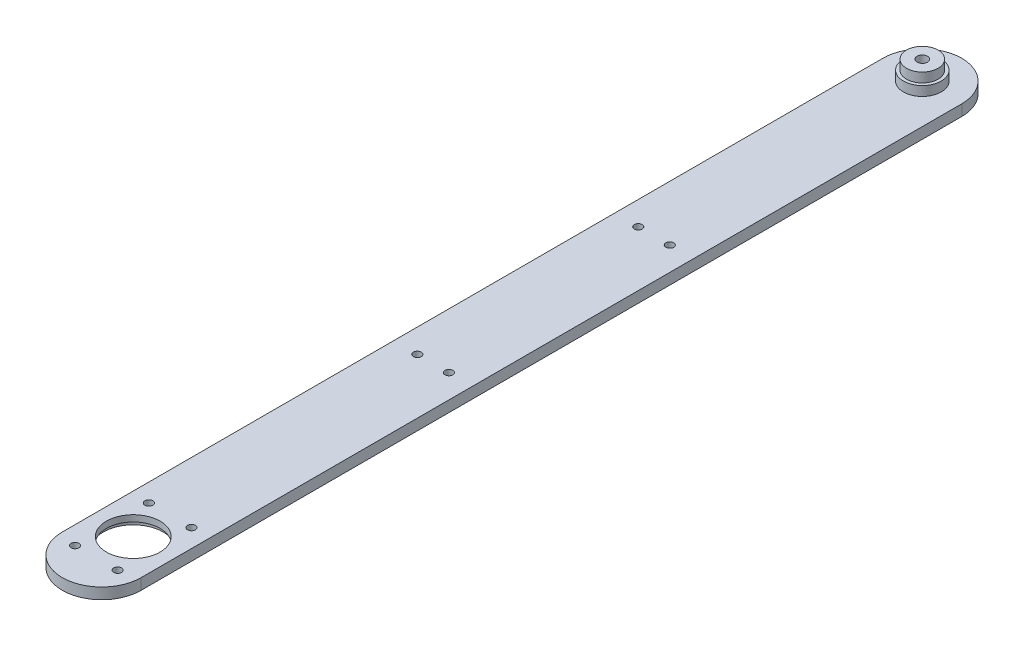
ISO-10303-21;
HEADER;
FILE_DESCRIPTION(('STEP AP214'),'2;1');
FILE_NAME('part.step','',(''),(''),'','','');
FILE_SCHEMA(('AUTOMOTIVE_DESIGN { 1 0 10303 214 1 1 1 1 }'));
ENDSEC;
DATA;
#1=APPLICATION_CONTEXT('core data for automotive mechanical design processes');
#2=APPLICATION_PROTOCOL_DEFINITION('international standard','automotive_design',2000,#1);
#3=PRODUCT_CONTEXT('',#1,'mechanical');
#4=PRODUCT('Part','Part','',(#3));
#5=PRODUCT_RELATED_PRODUCT_CATEGORY('part','',(#4));
#6=PRODUCT_DEFINITION_FORMATION('','',#4);
#7=PRODUCT_DEFINITION_CONTEXT('part definition',#1,'design');
#8=PRODUCT_DEFINITION('design','',#6,#7);
#9=PRODUCT_DEFINITION_SHAPE('','',#8);
#10=(LENGTH_UNIT() NAMED_UNIT(*) SI_UNIT(.MILLI.,.METRE.));
#11=(NAMED_UNIT(*) PLANE_ANGLE_UNIT() SI_UNIT($,.RADIAN.));
#12=(NAMED_UNIT(*) SI_UNIT($,.STERADIAN.) SOLID_ANGLE_UNIT());
#13=UNCERTAINTY_MEASURE_WITH_UNIT(LENGTH_MEASURE(1.E-05),#10,'distance_accuracy_value','');
#14=(GEOMETRIC_REPRESENTATION_CONTEXT(3) GLOBAL_UNCERTAINTY_ASSIGNED_CONTEXT((#13)) GLOBAL_UNIT_ASSIGNED_CONTEXT((#10,
#11,#12)) REPRESENTATION_CONTEXT('',''));
#15=CARTESIAN_POINT('',(0.,0.,0.));
#16=DIRECTION('',(0.,0.,1.));
#17=DIRECTION('',(1.,0.,0.));
#18=AXIS2_PLACEMENT_3D('',#15,#16,#17);
#19=CARTESIAN_POINT('',(-23.3733322792316,1.,-1111.));
#20=DIRECTION('',(0.,1.,0.));
#21=DIRECTION('',(0.,0.,1.));
#22=AXIS2_PLACEMENT_3D('',#19,#20,#21);
#23=PLANE('',#22);
#24=CARTESIAN_POINT('',(6.75000000000007,1.,238.30865704891));
#25=DIRECTION('',(0.,-1.,0.));
#26=DIRECTION('',(0.,0.,-1.));
#27=AXIS2_PLACEMENT_3D('',#24,#25,#26);
#28=CIRCLE('',#27,1.25);
#29=CARTESIAN_POINT('',(6.75000000000007,1.,237.05865704891));
#30=VERTEX_POINT('',#29);
#31=EDGE_CURVE('E278',#30,#30,#28,.T.);
#32=ORIENTED_EDGE('',*,*,#31,.F.);
#33=EDGE_LOOP('',(#32));
#34=FACE_BOUND('',#33,.T.);
#35=CARTESIAN_POINT('',(-6.74999999999987,1.,238.30865704891));
#36=DIRECTION('',(0.,-1.,0.));
#37=DIRECTION('',(0.,0.,-1.));
#38=AXIS2_PLACEMENT_3D('',#35,#36,#37);
#39=CIRCLE('',#38,1.25);
#40=CARTESIAN_POINT('',(-6.74999999999987,1.,237.05865704891));
#41=VERTEX_POINT('',#40);
#42=EDGE_CURVE('E284',#41,#41,#39,.T.);
#43=ORIENTED_EDGE('',*,*,#42,.F.);
#44=EDGE_LOOP('',(#43));
#45=FACE_BOUND('',#44,.T.);
#46=CARTESIAN_POINT('',(-6.75000000000001,1.,261.69134295109));
#47=DIRECTION('',(0.,-1.,0.));
#48=DIRECTION('',(0.,0.,-1.));
#49=AXIS2_PLACEMENT_3D('',#46,#47,#48);
#50=CIRCLE('',#49,1.25);
#51=CARTESIAN_POINT('',(-6.75000000000001,1.,260.44134295109));
#52=VERTEX_POINT('',#51);
#53=EDGE_CURVE('E292',#52,#52,#50,.T.);
#54=ORIENTED_EDGE('',*,*,#53,.F.);
#55=EDGE_LOOP('',(#54));
#56=FACE_BOUND('',#55,.T.);
#57=CARTESIAN_POINT('',(-4.99999999999999,1.,85.));
#58=DIRECTION('',(0.,-1.,0.));
#59=DIRECTION('',(0.,0.,-1.));
#60=AXIS2_PLACEMENT_3D('',#57,#58,#59);
#61=CIRCLE('',#60,1.25);
#62=CARTESIAN_POINT('',(-4.99999999999999,1.,83.75));
#63=VERTEX_POINT('',#62);
#64=EDGE_CURVE('E137',#63,#63,#61,.T.);
#65=ORIENTED_EDGE('',*,*,#64,.F.);
#66=EDGE_LOOP('',(#65));
#67=FACE_BOUND('',#66,.T.);
#68=CARTESIAN_POINT('',(0.,1.,0.));
#69=DIRECTION('',(0.,1.,0.));
#70=DIRECTION('',(0.,0.,1.));
#71=AXIS2_PLACEMENT_3D('',#68,#69,#70);
#72=CIRCLE('',#71,12.5);
#73=CARTESIAN_POINT('',(-12.5,1.,0.));
#74=VERTEX_POINT('',#73);
#75=CARTESIAN_POINT('',(12.5,1.,0.));
#76=VERTEX_POINT('',#75);
#77=EDGE_CURVE('E86',#74,#76,#72,.F.);
#78=ORIENTED_EDGE('',*,*,#77,.T.);
#79=DIRECTION('',(0.,0.,1.));
#80=VECTOR('',#79,1.);
#81=CARTESIAN_POINT('',(12.5,1.,0.));
#82=LINE('',#81,#80);
#83=CARTESIAN_POINT('',(12.5,1.,260.));
#84=VERTEX_POINT('',#83);
#85=EDGE_CURVE('E100',#76,#84,#82,.T.);
#86=ORIENTED_EDGE('',*,*,#85,.T.);
#87=CARTESIAN_POINT('',(0.,1.,260.));
#88=DIRECTION('',(0.,1.,0.));
#89=DIRECTION('',(0.,0.,1.));
#90=AXIS2_PLACEMENT_3D('',#87,#88,#89);
#91=CIRCLE('',#90,12.5);
#92=CARTESIAN_POINT('',(-12.4999999999999,1.,260.));
#93=VERTEX_POINT('',#92);
#94=EDGE_CURVE('E58',#84,#93,#91,.F.);
#95=ORIENTED_EDGE('',*,*,#94,.T.);
#96=DIRECTION('',(0.,0.,-1.));
#97=VECTOR('',#96,1.);
#98=CARTESIAN_POINT('',(-12.5,1.,0.));
#99=LINE('',#98,#97);
#100=EDGE_CURVE('E83',#93,#74,#99,.T.);
#101=ORIENTED_EDGE('',*,*,#100,.T.);
#102=EDGE_LOOP('',(#78,#86,#95,#101));
#103=FACE_BOUND('',#102,.T.);
#104=CARTESIAN_POINT('',(0.,0.999999999999999,0.));
#105=DIRECTION('',(0.,1.,0.));
#106=DIRECTION('',(0.,0.,1.));
#107=AXIS2_PLACEMENT_3D('',#104,#105,#106);
#108=CIRCLE('',#107,1.65);
#109=CARTESIAN_POINT('',(0.,0.999999999999999,1.65));
#110=VERTEX_POINT('',#109);
#111=EDGE_CURVE('E133',#110,#110,#108,.F.);
#112=ORIENTED_EDGE('',*,*,#111,.F.);
#113=EDGE_LOOP('',(#112));
#114=FACE_BOUND('',#113,.T.);
#115=CARTESIAN_POINT('',(0.,1.,250.));
#116=DIRECTION('',(0.,1.,0.));
#117=DIRECTION('',(0.,0.,1.));
#118=AXIS2_PLACEMENT_3D('',#115,#116,#117);
#119=CIRCLE('',#118,9.50000000000001);
#120=CARTESIAN_POINT('',(0.,1.,259.5));
#121=VERTEX_POINT('',#120);
#122=EDGE_CURVE('E91',#121,#121,#119,.F.);
#123=ORIENTED_EDGE('',*,*,#122,.F.);
#124=EDGE_LOOP('',(#123));
#125=FACE_BOUND('',#124,.T.);
#126=CARTESIAN_POINT('',(-4.99999999999997,1.,155.));
#127=DIRECTION('',(0.,-1.,0.));
#128=DIRECTION('',(0.,0.,-1.));
#129=AXIS2_PLACEMENT_3D('',#126,#127,#128);
#130=CIRCLE('',#129,1.25);
#131=CARTESIAN_POINT('',(-4.99999999999997,1.,153.75));
#132=VERTEX_POINT('',#131);
#133=EDGE_CURVE('E141',#132,#132,#130,.T.);
#134=ORIENTED_EDGE('',*,*,#133,.F.);
#135=EDGE_LOOP('',(#134));
#136=FACE_BOUND('',#135,.T.);
#137=CARTESIAN_POINT('',(5.00000000000001,1.,85.));
#138=DIRECTION('',(0.,-1.,0.));
#139=DIRECTION('',(0.,0.,-1.));
#140=AXIS2_PLACEMENT_3D('',#137,#138,#139);
#141=CIRCLE('',#140,1.25);
#142=CARTESIAN_POINT('',(5.00000000000001,1.,83.75));
#143=VERTEX_POINT('',#142);
#144=EDGE_CURVE('E149',#143,#143,#141,.T.);
#145=ORIENTED_EDGE('',*,*,#144,.F.);
#146=EDGE_LOOP('',(#145));
#147=FACE_BOUND('',#146,.T.);
#148=CARTESIAN_POINT('',(5.00000000000003,1.,155.));
#149=DIRECTION('',(0.,-1.,0.));
#150=DIRECTION('',(0.,0.,-1.));
#151=AXIS2_PLACEMENT_3D('',#148,#149,#150);
#152=CIRCLE('',#151,1.25);
#153=CARTESIAN_POINT('',(5.00000000000003,1.,153.75));
#154=VERTEX_POINT('',#153);
#155=EDGE_CURVE('E11',#154,#154,#152,.T.);
#156=ORIENTED_EDGE('',*,*,#155,.F.);
#157=EDGE_LOOP('',(#156));
#158=FACE_BOUND('',#157,.T.);
#159=CARTESIAN_POINT('',(6.74999999999987,1.,261.69134295109));
#160=DIRECTION('',(0.,-1.,0.));
#161=DIRECTION('',(0.,0.,-1.));
#162=AXIS2_PLACEMENT_3D('',#159,#160,#161);
#163=CIRCLE('',#162,1.25);
#164=CARTESIAN_POINT('',(6.74999999999987,1.,260.44134295109));
#165=VERTEX_POINT('',#164);
#166=EDGE_CURVE('E271',#165,#165,#163,.T.);
#167=ORIENTED_EDGE('',*,*,#166,.F.);
#168=EDGE_LOOP('',(#167));
#169=FACE_BOUND('',#168,.T.);
#170=ADVANCED_FACE('F41',(#34,#45,#56,#67,#103,#114,#125,#136,#147,#158,#169),#23,.F.);
#171=CARTESIAN_POINT('',(5.00000000000003,1.,155.));
#172=DIRECTION('',(0.,-1.,0.));
#173=DIRECTION('',(0.,0.,-1.));
#174=AXIS2_PLACEMENT_3D('',#171,#172,#173);
#175=CYLINDRICAL_SURFACE('',#174,1.25);
#176=CARTESIAN_POINT('',(5.00000000000003,4.5,155.));
#177=DIRECTION('',(0.,1.,0.));
#178=DIRECTION('',(0.,0.,1.));
#179=AXIS2_PLACEMENT_3D('',#176,#177,#178);
#180=CIRCLE('',#179,1.25);
#181=CARTESIAN_POINT('',(5.00000000000003,4.5,156.25));
#182=VERTEX_POINT('',#181);
#183=EDGE_CURVE('E51',#182,#182,#180,.T.);
#184=ORIENTED_EDGE('',*,*,#183,.T.);
#185=EDGE_LOOP('',(#184));
#186=FACE_BOUND('',#185,.T.);
#187=ORIENTED_EDGE('',*,*,#155,.T.);
#188=EDGE_LOOP('',(#187));
#189=FACE_BOUND('',#188,.T.);
#190=ADVANCED_FACE('F43',(#186,#189),#175,.F.);
#191=CARTESIAN_POINT('',(5.00000000000001,1.,85.));
#192=DIRECTION('',(0.,-1.,0.));
#193=DIRECTION('',(0.,0.,-1.));
#194=AXIS2_PLACEMENT_3D('',#191,#192,#193);
#195=CYLINDRICAL_SURFACE('',#194,1.25);
#196=CARTESIAN_POINT('',(5.00000000000001,4.5,85.));
#197=DIRECTION('',(0.,1.,0.));
#198=DIRECTION('',(0.,0.,1.));
#199=AXIS2_PLACEMENT_3D('',#196,#197,#198);
#200=CIRCLE('',#199,1.25);
#201=CARTESIAN_POINT('',(5.00000000000001,4.5,86.25));
#202=VERTEX_POINT('',#201);
#203=EDGE_CURVE('E145',#202,#202,#200,.T.);
#204=ORIENTED_EDGE('',*,*,#203,.T.);
#205=EDGE_LOOP('',(#204));
#206=FACE_BOUND('',#205,.T.);
#207=ORIENTED_EDGE('',*,*,#144,.T.);
#208=EDGE_LOOP('',(#207));
#209=FACE_BOUND('',#208,.T.);
#210=ADVANCED_FACE('F182',(#206,#209),#195,.F.);
#211=CARTESIAN_POINT('',(-4.99999999999997,1.,155.));
#212=DIRECTION('',(0.,-1.,0.));
#213=DIRECTION('',(0.,0.,-1.));
#214=AXIS2_PLACEMENT_3D('',#211,#212,#213);
#215=CYLINDRICAL_SURFACE('',#214,1.25);
#216=CARTESIAN_POINT('',(-4.99999999999997,4.5,155.));
#217=DIRECTION('',(0.,1.,0.));
#218=DIRECTION('',(0.,0.,1.));
#219=AXIS2_PLACEMENT_3D('',#216,#217,#218);
#220=CIRCLE('',#219,1.25);
#221=CARTESIAN_POINT('',(-4.99999999999997,4.5,156.25));
#222=VERTEX_POINT('',#221);
#223=EDGE_CURVE('E126',#222,#222,#220,.T.);
#224=ORIENTED_EDGE('',*,*,#223,.T.);
#225=EDGE_LOOP('',(#224));
#226=FACE_BOUND('',#225,.T.);
#227=ORIENTED_EDGE('',*,*,#133,.T.);
#228=EDGE_LOOP('',(#227));
#229=FACE_BOUND('',#228,.T.);
#230=ADVANCED_FACE('F250',(#226,#229),#215,.F.);
#231=CARTESIAN_POINT('',(0.,-4.5,0.));
#232=DIRECTION('',(0.,1.,0.));
#233=DIRECTION('',(0.,0.,1.));
#234=AXIS2_PLACEMENT_3D('',#231,#232,#233);
#235=CYLINDRICAL_SURFACE('',#234,12.5);
#236=ORIENTED_EDGE('',*,*,#77,.F.);
#237=DIRECTION('',(0.,1.,0.));
#238=VECTOR('',#237,1.);
#239=CARTESIAN_POINT('',(-12.5,-4.5,0.));
#240=LINE('',#239,#238);
#241=CARTESIAN_POINT('',(-12.5,4.5,0.));
#242=VERTEX_POINT('',#241);
#243=EDGE_CURVE('E96',#74,#242,#240,.T.);
#244=ORIENTED_EDGE('',*,*,#243,.T.);
#245=CARTESIAN_POINT('',(0.,4.5,0.));
#246=DIRECTION('',(0.,1.,0.));
#247=DIRECTION('',(0.,0.,1.));
#248=AXIS2_PLACEMENT_3D('',#245,#246,#247);
#249=CIRCLE('',#248,12.5);
#250=CARTESIAN_POINT('',(12.5,4.5,0.));
#251=VERTEX_POINT('',#250);
#252=EDGE_CURVE('E220',#251,#242,#249,.T.);
#253=ORIENTED_EDGE('',*,*,#252,.F.);
#254=DIRECTION('',(0.,1.,0.));
#255=VECTOR('',#254,1.);
#256=CARTESIAN_POINT('',(12.5,-4.5,0.));
#257=LINE('',#256,#255);
#258=EDGE_CURVE('E66',#76,#251,#257,.T.);
#259=ORIENTED_EDGE('',*,*,#258,.F.);
#260=EDGE_LOOP('',(#236,#244,#253,#259));
#261=FACE_BOUND('',#260,.T.);
#262=ADVANCED_FACE('F94',(#261),#235,.T.);
#263=CARTESIAN_POINT('',(12.5,-4.5,0.));
#264=DIRECTION('',(1.,0.,0.));
#265=DIRECTION('',(0.,0.,-1.));
#266=AXIS2_PLACEMENT_3D('',#263,#264,#265);
#267=PLANE('',#266);
#268=ORIENTED_EDGE('',*,*,#85,.F.);
#269=ORIENTED_EDGE('',*,*,#258,.T.);
#270=DIRECTION('',(0.,0.,-1.));
#271=VECTOR('',#270,1.);
#272=CARTESIAN_POINT('',(12.5,4.5,0.));
#273=LINE('',#272,#271);
#274=CARTESIAN_POINT('',(12.5,4.5,260.));
#275=VERTEX_POINT('',#274);
#276=EDGE_CURVE('E108',#275,#251,#273,.T.);
#277=ORIENTED_EDGE('',*,*,#276,.F.);
#278=DIRECTION('',(0.,1.,0.));
#279=VECTOR('',#278,1.);
#280=CARTESIAN_POINT('',(12.5,-4.5,260.));
#281=LINE('',#280,#279);
#282=EDGE_CURVE('E112',#84,#275,#281,.T.);
#283=ORIENTED_EDGE('',*,*,#282,.F.);
#284=EDGE_LOOP('',(#268,#269,#277,#283));
#285=FACE_BOUND('',#284,.T.);
#286=ADVANCED_FACE('F243',(#285),#267,.T.);
#287=CARTESIAN_POINT('',(0.,-4.5,260.));
#288=DIRECTION('',(0.,1.,0.));
#289=DIRECTION('',(0.,0.,1.));
#290=AXIS2_PLACEMENT_3D('',#287,#288,#289);
#291=CYLINDRICAL_SURFACE('',#290,12.5);
#292=ORIENTED_EDGE('',*,*,#94,.F.);
#293=ORIENTED_EDGE('',*,*,#282,.T.);
#294=CARTESIAN_POINT('',(0.,4.5,260.));
#295=DIRECTION('',(0.,1.,0.));
#296=DIRECTION('',(0.,0.,1.));
#297=AXIS2_PLACEMENT_3D('',#294,#295,#296);
#298=CIRCLE('',#297,12.5);
#299=CARTESIAN_POINT('',(-12.4999999999999,4.5,260.));
#300=VERTEX_POINT('',#299);
#301=EDGE_CURVE('E114',#300,#275,#298,.T.);
#302=ORIENTED_EDGE('',*,*,#301,.F.);
#303=DIRECTION('',(0.,1.,0.));
#304=VECTOR('',#303,1.);
#305=CARTESIAN_POINT('',(-12.4999999999999,-4.5,260.));
#306=LINE('',#305,#304);
#307=EDGE_CURVE('E107',#93,#300,#306,.T.);
#308=ORIENTED_EDGE('',*,*,#307,.F.);
#309=EDGE_LOOP('',(#292,#293,#302,#308));
#310=FACE_BOUND('',#309,.T.);
#311=ADVANCED_FACE('F171',(#310),#291,.T.);
#312=CARTESIAN_POINT('',(-12.5,-4.5,0.));
#313=DIRECTION('',(-1.,0.,0.));
#314=DIRECTION('',(0.,0.,1.));
#315=AXIS2_PLACEMENT_3D('',#312,#313,#314);
#316=PLANE('',#315);
#317=ORIENTED_EDGE('',*,*,#100,.F.);
#318=ORIENTED_EDGE('',*,*,#307,.T.);
#319=DIRECTION('',(0.,0.,1.));
#320=VECTOR('',#319,1.);
#321=CARTESIAN_POINT('',(-12.5,4.5,0.));
#322=LINE('',#321,#320);
#323=EDGE_CURVE('E104',#242,#300,#322,.T.);
#324=ORIENTED_EDGE('',*,*,#323,.F.);
#325=ORIENTED_EDGE('',*,*,#243,.F.);
#326=EDGE_LOOP('',(#317,#318,#324,#325));
#327=FACE_BOUND('',#326,.T.);
#328=ADVANCED_FACE('F102',(#327),#316,.T.);
#329=CARTESIAN_POINT('',(0.,4.5,0.));
#330=DIRECTION('',(0.,1.,0.));
#331=DIRECTION('',(0.,0.,1.));
#332=AXIS2_PLACEMENT_3D('',#329,#330,#331);
#333=PLANE('',#332);
#334=CARTESIAN_POINT('',(6.74999999999987,4.5,261.69134295109));
#335=DIRECTION('',(0.,1.,0.));
#336=DIRECTION('',(0.,0.,1.));
#337=AXIS2_PLACEMENT_3D('',#334,#335,#336);
#338=CIRCLE('',#337,1.25);
#339=CARTESIAN_POINT('',(6.74999999999987,4.5,262.94134295109));
#340=VERTEX_POINT('',#339);
#341=EDGE_CURVE('E274',#340,#340,#338,.T.);
#342=ORIENTED_EDGE('',*,*,#341,.F.);
#343=EDGE_LOOP('',(#342));
#344=FACE_BOUND('',#343,.T.);
#345=CARTESIAN_POINT('',(6.75000000000007,4.5,238.30865704891));
#346=DIRECTION('',(0.,1.,0.));
#347=DIRECTION('',(0.,0.,1.));
#348=AXIS2_PLACEMENT_3D('',#345,#346,#347);
#349=CIRCLE('',#348,1.25);
#350=CARTESIAN_POINT('',(6.75000000000007,4.5,239.55865704891));
#351=VERTEX_POINT('',#350);
#352=EDGE_CURVE('E45',#351,#351,#349,.T.);
#353=ORIENTED_EDGE('',*,*,#352,.F.);
#354=EDGE_LOOP('',(#353));
#355=FACE_BOUND('',#354,.T.);
#356=CARTESIAN_POINT('',(-6.74999999999987,4.5,238.30865704891));
#357=DIRECTION('',(0.,1.,0.));
#358=DIRECTION('',(0.,0.,1.));
#359=AXIS2_PLACEMENT_3D('',#356,#357,#358);
#360=CIRCLE('',#359,1.25);
#361=CARTESIAN_POINT('',(-6.74999999999987,4.5,239.55865704891));
#362=VERTEX_POINT('',#361);
#363=EDGE_CURVE('E288',#362,#362,#360,.T.);
#364=ORIENTED_EDGE('',*,*,#363,.F.);
#365=EDGE_LOOP('',(#364));
#366=FACE_BOUND('',#365,.T.);
#367=CARTESIAN_POINT('',(-6.75000000000001,4.5,261.69134295109));
#368=DIRECTION('',(0.,1.,0.));
#369=DIRECTION('',(0.,0.,1.));
#370=AXIS2_PLACEMENT_3D('',#367,#368,#369);
#371=CIRCLE('',#370,1.25);
#372=CARTESIAN_POINT('',(-6.75000000000001,4.5,262.94134295109));
#373=VERTEX_POINT('',#372);
#374=EDGE_CURVE('E296',#373,#373,#371,.T.);
#375=ORIENTED_EDGE('',*,*,#374,.F.);
#376=EDGE_LOOP('',(#375));
#377=FACE_BOUND('',#376,.T.);
#378=CARTESIAN_POINT('',(-4.99999999999999,4.5,85.));
#379=DIRECTION('',(0.,1.,0.));
#380=DIRECTION('',(0.,0.,1.));
#381=AXIS2_PLACEMENT_3D('',#378,#379,#380);
#382=CIRCLE('',#381,1.25);
#383=CARTESIAN_POINT('',(-4.99999999999999,4.5,86.25));
#384=VERTEX_POINT('',#383);
#385=EDGE_CURVE('E300',#384,#384,#382,.T.);
#386=ORIENTED_EDGE('',*,*,#385,.F.);
#387=EDGE_LOOP('',(#386));
#388=FACE_BOUND('',#387,.T.);
#389=CARTESIAN_POINT('',(0.,4.5,250.));
#390=DIRECTION('',(0.,1.,0.));
#391=DIRECTION('',(0.,0.,1.));
#392=AXIS2_PLACEMENT_3D('',#389,#390,#391);
#393=CIRCLE('',#392,8.50000000000001);
#394=CARTESIAN_POINT('',(0.,4.5,258.5));
#395=VERTEX_POINT('',#394);
#396=EDGE_CURVE('E127',#395,#395,#393,.T.);
#397=ORIENTED_EDGE('',*,*,#396,.F.);
#398=EDGE_LOOP('',(#397));
#399=FACE_BOUND('',#398,.T.);
#400=CARTESIAN_POINT('',(0.,4.5,0.));
#401=DIRECTION('',(0.,1.,0.));
#402=DIRECTION('',(0.,0.,1.));
#403=AXIS2_PLACEMENT_3D('',#400,#401,#402);
#404=CIRCLE('',#403,6.);
#405=CARTESIAN_POINT('',(0.,4.5,6.));
#406=VERTEX_POINT('',#405);
#407=EDGE_CURVE('E221',#406,#406,#404,.T.);
#408=ORIENTED_EDGE('',*,*,#407,.F.);
#409=EDGE_LOOP('',(#408));
#410=FACE_BOUND('',#409,.T.);
#411=ORIENTED_EDGE('',*,*,#252,.T.);
#412=ORIENTED_EDGE('',*,*,#323,.T.);
#413=ORIENTED_EDGE('',*,*,#301,.T.);
#414=ORIENTED_EDGE('',*,*,#276,.T.);
#415=EDGE_LOOP('',(#411,#412,#413,#414));
#416=FACE_BOUND('',#415,.T.);
#417=ORIENTED_EDGE('',*,*,#223,.F.);
#418=EDGE_LOOP('',(#417));
#419=FACE_BOUND('',#418,.T.);
#420=ORIENTED_EDGE('',*,*,#203,.F.);
#421=EDGE_LOOP('',(#420));
#422=FACE_BOUND('',#421,.T.);
#423=ORIENTED_EDGE('',*,*,#183,.F.);
#424=EDGE_LOOP('',(#423));
#425=FACE_BOUND('',#424,.T.);
#426=ADVANCED_FACE('F159',(#344,#355,#366,#377,#388,#399,#410,#416,#419,#422,#425),#333,.T.);
#427=CARTESIAN_POINT('',(0.,7.5,0.));
#428=DIRECTION('',(0.,-1.,0.));
#429=DIRECTION('',(0.,0.,-1.));
#430=AXIS2_PLACEMENT_3D('',#427,#428,#429);
#431=CYLINDRICAL_SURFACE('',#430,6.);
#432=CARTESIAN_POINT('',(0.,7.5,0.));
#433=DIRECTION('',(0.,1.,0.));
#434=DIRECTION('',(0.,0.,1.));
#435=AXIS2_PLACEMENT_3D('',#432,#433,#434);
#436=CIRCLE('',#435,6.);
#437=CARTESIAN_POINT('',(0.,7.5,6.));
#438=VERTEX_POINT('',#437);
#439=EDGE_CURVE('E218',#438,#438,#436,.T.);
#440=ORIENTED_EDGE('',*,*,#439,.F.);
#441=EDGE_LOOP('',(#440));
#442=FACE_BOUND('',#441,.T.);
#443=ORIENTED_EDGE('',*,*,#407,.T.);
#444=EDGE_LOOP('',(#443));
#445=FACE_BOUND('',#444,.T.);
#446=ADVANCED_FACE('F161',(#442,#445),#431,.T.);
#447=CARTESIAN_POINT('',(0.,7.5,0.));
#448=DIRECTION('',(0.,1.,0.));
#449=DIRECTION('',(0.,0.,1.));
#450=AXIS2_PLACEMENT_3D('',#447,#448,#449);
#451=PLANE('',#450);
#452=CARTESIAN_POINT('',(0.,7.5,0.));
#453=DIRECTION('',(0.,1.,0.));
#454=DIRECTION('',(0.,0.,1.));
#455=AXIS2_PLACEMENT_3D('',#452,#453,#454);
#456=CIRCLE('',#455,5.);
#457=CARTESIAN_POINT('',(0.,7.5,5.));
#458=VERTEX_POINT('',#457);
#459=EDGE_CURVE('E122',#458,#458,#456,.F.);
#460=ORIENTED_EDGE('',*,*,#459,.T.);
#461=EDGE_LOOP('',(#460));
#462=FACE_BOUND('',#461,.T.);
#463=ORIENTED_EDGE('',*,*,#439,.T.);
#464=EDGE_LOOP('',(#463));
#465=FACE_BOUND('',#464,.T.);
#466=ADVANCED_FACE('F168',(#462,#465),#451,.T.);
#467=CARTESIAN_POINT('',(0.,10.5,0.));
#468=DIRECTION('',(0.,1.,0.));
#469=DIRECTION('',(0.,0.,1.));
#470=AXIS2_PLACEMENT_3D('',#467,#468,#469);
#471=PLANE('',#470);
#472=CARTESIAN_POINT('',(0.,10.5,0.));
#473=DIRECTION('',(0.,-1.,0.));
#474=DIRECTION('',(0.,0.,-1.));
#475=AXIS2_PLACEMENT_3D('',#472,#473,#474);
#476=CIRCLE('',#475,1.64999999999999);
#477=CARTESIAN_POINT('',(0.,10.5,-1.64999999999999));
#478=VERTEX_POINT('',#477);
#479=EDGE_CURVE('E99',#478,#478,#476,.T.);
#480=ORIENTED_EDGE('',*,*,#479,.T.);
#481=EDGE_LOOP('',(#480));
#482=FACE_BOUND('',#481,.T.);
#483=CARTESIAN_POINT('',(0.,10.5,0.));
#484=DIRECTION('',(0.,1.,0.));
#485=DIRECTION('',(0.,0.,1.));
#486=AXIS2_PLACEMENT_3D('',#483,#484,#485);
#487=CIRCLE('',#486,5.);
#488=CARTESIAN_POINT('',(0.,10.5,5.));
#489=VERTEX_POINT('',#488);
#490=EDGE_CURVE('E118',#489,#489,#487,.T.);
#491=ORIENTED_EDGE('',*,*,#490,.T.);
#492=EDGE_LOOP('',(#491));
#493=FACE_BOUND('',#492,.T.);
#494=ADVANCED_FACE('F207',(#482,#493),#471,.T.);
#495=CARTESIAN_POINT('',(0.,-10.5,0.));
#496=DIRECTION('',(0.,1.,0.));
#497=DIRECTION('',(0.,0.,1.));
#498=AXIS2_PLACEMENT_3D('',#495,#496,#497);
#499=CYLINDRICAL_SURFACE('',#498,5.);
#500=ORIENTED_EDGE('',*,*,#459,.F.);
#501=EDGE_LOOP('',(#500));
#502=FACE_BOUND('',#501,.T.);
#503=ORIENTED_EDGE('',*,*,#490,.F.);
#504=EDGE_LOOP('',(#503));
#505=FACE_BOUND('',#504,.T.);
#506=ADVANCED_FACE('F204',(#502,#505),#499,.T.);
#507=CARTESIAN_POINT('',(0.,2.5,250.));
#508=DIRECTION('',(0.,-1.,0.));
#509=DIRECTION('',(0.,0.,-1.));
#510=AXIS2_PLACEMENT_3D('',#507,#508,#509);
#511=CYLINDRICAL_SURFACE('',#510,9.50000000000001);
#512=ORIENTED_EDGE('',*,*,#122,.T.);
#513=EDGE_LOOP('',(#512));
#514=FACE_BOUND('',#513,.T.);
#515=CARTESIAN_POINT('',(0.,2.5,250.));
#516=DIRECTION('',(0.,-1.,0.));
#517=DIRECTION('',(0.,0.,-1.));
#518=AXIS2_PLACEMENT_3D('',#515,#516,#517);
#519=CIRCLE('',#518,9.50000000000001);
#520=CARTESIAN_POINT('',(0.,2.5,240.5));
#521=VERTEX_POINT('',#520);
#522=EDGE_CURVE('E131',#521,#521,#519,.T.);
#523=ORIENTED_EDGE('',*,*,#522,.F.);
#524=EDGE_LOOP('',(#523));
#525=FACE_BOUND('',#524,.T.);
#526=ADVANCED_FACE('F200',(#514,#525),#511,.F.);
#527=CARTESIAN_POINT('',(0.,2.5,250.));
#528=DIRECTION('',(0.,-1.,0.));
#529=DIRECTION('',(0.,0.,-1.));
#530=AXIS2_PLACEMENT_3D('',#527,#528,#529);
#531=PLANE('',#530);
#532=CARTESIAN_POINT('',(0.,2.5,250.));
#533=DIRECTION('',(0.,-1.,0.));
#534=DIRECTION('',(0.,0.,-1.));
#535=AXIS2_PLACEMENT_3D('',#532,#533,#534);
#536=CIRCLE('',#535,8.50000000000001);
#537=CARTESIAN_POINT('',(0.,2.5,241.5));
#538=VERTEX_POINT('',#537);
#539=EDGE_CURVE('E132',#538,#538,#536,.T.);
#540=ORIENTED_EDGE('',*,*,#539,.F.);
#541=EDGE_LOOP('',(#540));
#542=FACE_BOUND('',#541,.T.);
#543=ORIENTED_EDGE('',*,*,#522,.T.);
#544=EDGE_LOOP('',(#543));
#545=FACE_BOUND('',#544,.T.);
#546=ADVANCED_FACE('F196',(#542,#545),#531,.T.);
#547=CARTESIAN_POINT('',(0.,10.5,250.));
#548=DIRECTION('',(0.,-1.,0.));
#549=DIRECTION('',(0.,0.,-1.));
#550=AXIS2_PLACEMENT_3D('',#547,#548,#549);
#551=CYLINDRICAL_SURFACE('',#550,8.50000000000001);
#552=ORIENTED_EDGE('',*,*,#396,.T.);
#553=EDGE_LOOP('',(#552));
#554=FACE_BOUND('',#553,.T.);
#555=ORIENTED_EDGE('',*,*,#539,.T.);
#556=EDGE_LOOP('',(#555));
#557=FACE_BOUND('',#556,.T.);
#558=ADVANCED_FACE('F192',(#554,#557),#551,.F.);
#559=CARTESIAN_POINT('',(0.,-10.5,0.));
#560=DIRECTION('',(0.,-1.,0.));
#561=DIRECTION('',(0.,0.,-1.));
#562=AXIS2_PLACEMENT_3D('',#559,#560,#561);
#563=CYLINDRICAL_SURFACE('',#562,1.65);
#564=ORIENTED_EDGE('',*,*,#111,.T.);
#565=EDGE_LOOP('',(#564));
#566=FACE_BOUND('',#565,.T.);
#567=ORIENTED_EDGE('',*,*,#479,.F.);
#568=EDGE_LOOP('',(#567));
#569=FACE_BOUND('',#568,.T.);
#570=ADVANCED_FACE('F189',(#566,#569),#563,.F.);
#571=CARTESIAN_POINT('',(-4.99999999999999,1.,85.));
#572=DIRECTION('',(0.,-1.,0.));
#573=DIRECTION('',(0.,0.,-1.));
#574=AXIS2_PLACEMENT_3D('',#571,#572,#573);
#575=CYLINDRICAL_SURFACE('',#574,1.25);
#576=ORIENTED_EDGE('',*,*,#385,.T.);
#577=EDGE_LOOP('',(#576));
#578=FACE_BOUND('',#577,.T.);
#579=ORIENTED_EDGE('',*,*,#64,.T.);
#580=EDGE_LOOP('',(#579));
#581=FACE_BOUND('',#580,.T.);
#582=ADVANCED_FACE('F187',(#578,#581),#575,.F.);
#583=CARTESIAN_POINT('',(-6.75000000000001,1.,261.69134295109));
#584=DIRECTION('',(0.,-1.,0.));
#585=DIRECTION('',(0.,0.,-1.));
#586=AXIS2_PLACEMENT_3D('',#583,#584,#585);
#587=CYLINDRICAL_SURFACE('',#586,1.25);
#588=ORIENTED_EDGE('',*,*,#374,.T.);
#589=EDGE_LOOP('',(#588));
#590=FACE_BOUND('',#589,.T.);
#591=ORIENTED_EDGE('',*,*,#53,.T.);
#592=EDGE_LOOP('',(#591));
#593=FACE_BOUND('',#592,.T.);
#594=ADVANCED_FACE('F345',(#590,#593),#587,.F.);
#595=CARTESIAN_POINT('',(-6.74999999999987,1.,238.30865704891));
#596=DIRECTION('',(0.,-1.,0.));
#597=DIRECTION('',(0.,0.,-1.));
#598=AXIS2_PLACEMENT_3D('',#595,#596,#597);
#599=CYLINDRICAL_SURFACE('',#598,1.25);
#600=ORIENTED_EDGE('',*,*,#363,.T.);
#601=EDGE_LOOP('',(#600));
#602=FACE_BOUND('',#601,.T.);
#603=ORIENTED_EDGE('',*,*,#42,.T.);
#604=EDGE_LOOP('',(#603));
#605=FACE_BOUND('',#604,.T.);
#606=ADVANCED_FACE('F351',(#602,#605),#599,.F.);
#607=CARTESIAN_POINT('',(6.75000000000007,1.,238.30865704891));
#608=DIRECTION('',(0.,-1.,0.));
#609=DIRECTION('',(0.,0.,-1.));
#610=AXIS2_PLACEMENT_3D('',#607,#608,#609);
#611=CYLINDRICAL_SURFACE('',#610,1.25);
#612=ORIENTED_EDGE('',*,*,#352,.T.);
#613=EDGE_LOOP('',(#612));
#614=FACE_BOUND('',#613,.T.);
#615=ORIENTED_EDGE('',*,*,#31,.T.);
#616=EDGE_LOOP('',(#615));
#617=FACE_BOUND('',#616,.T.);
#618=ADVANCED_FACE('F329',(#614,#617),#611,.F.);
#619=CARTESIAN_POINT('',(6.74999999999987,1.,261.69134295109));
#620=DIRECTION('',(0.,-1.,0.));
#621=DIRECTION('',(0.,0.,-1.));
#622=AXIS2_PLACEMENT_3D('',#619,#620,#621);
#623=CYLINDRICAL_SURFACE('',#622,1.25);
#624=ORIENTED_EDGE('',*,*,#341,.T.);
#625=EDGE_LOOP('',(#624));
#626=FACE_BOUND('',#625,.T.);
#627=ORIENTED_EDGE('',*,*,#166,.T.);
#628=EDGE_LOOP('',(#627));
#629=FACE_BOUND('',#628,.T.);
#630=ADVANCED_FACE('F362',(#626,#629),#623,.F.);
#631=CLOSED_SHELL('',(#170,#190,#210,#230,#262,#286,#311,#328,#426,#446,#466,#494,#506,#526,
#546,#558,#570,#582,#594,#606,#618,#630));
#632=MANIFOLD_SOLID_BREP('B2',#631);
#633=ADVANCED_BREP_SHAPE_REPRESENTATION('',(#18,#632),#14);
#634=SHAPE_DEFINITION_REPRESENTATION(#9,#633);
ENDSEC;
END-ISO-10303-21;
